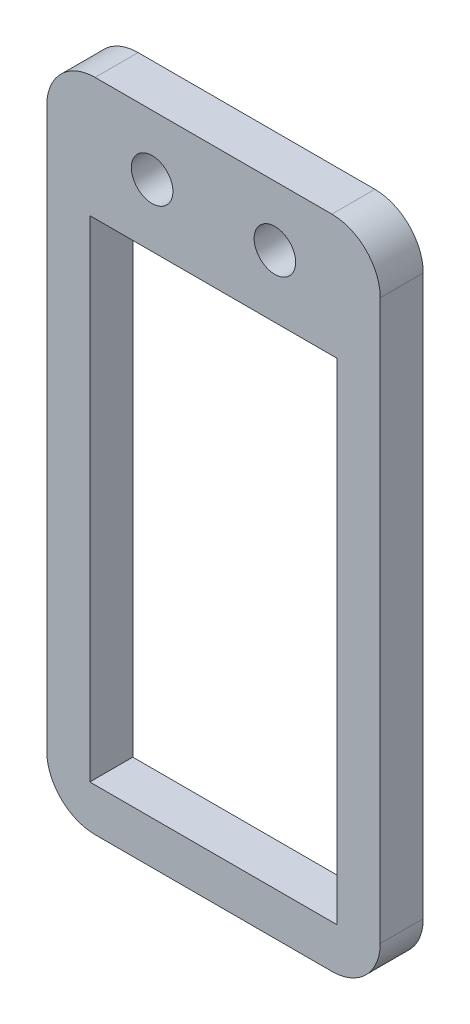
ISO-10303-21;
HEADER;
FILE_DESCRIPTION(('STEP AP214'),'2;1');
FILE_NAME('part.step','',(''),(''),'','','');
FILE_SCHEMA(('AUTOMOTIVE_DESIGN { 1 0 10303 214 1 1 1 1 }'));
ENDSEC;
DATA;
#1=APPLICATION_CONTEXT('core data for automotive mechanical design processes');
#2=APPLICATION_PROTOCOL_DEFINITION('international standard','automotive_design',2000,#1);
#3=PRODUCT_CONTEXT('',#1,'mechanical');
#4=PRODUCT('Part','Part','',(#3));
#5=PRODUCT_RELATED_PRODUCT_CATEGORY('part','',(#4));
#6=PRODUCT_DEFINITION_FORMATION('','',#4);
#7=PRODUCT_DEFINITION_CONTEXT('part definition',#1,'design');
#8=PRODUCT_DEFINITION('design','',#6,#7);
#9=PRODUCT_DEFINITION_SHAPE('','',#8);
#10=(LENGTH_UNIT() NAMED_UNIT(*) SI_UNIT(.MILLI.,.METRE.));
#11=(NAMED_UNIT(*) PLANE_ANGLE_UNIT() SI_UNIT($,.RADIAN.));
#12=(NAMED_UNIT(*) SI_UNIT($,.STERADIAN.) SOLID_ANGLE_UNIT());
#13=UNCERTAINTY_MEASURE_WITH_UNIT(LENGTH_MEASURE(1.E-05),#10,'distance_accuracy_value','');
#14=(GEOMETRIC_REPRESENTATION_CONTEXT(3) GLOBAL_UNCERTAINTY_ASSIGNED_CONTEXT((#13)) GLOBAL_UNIT_ASSIGNED_CONTEXT((#10,
#11,#12)) REPRESENTATION_CONTEXT('',''));
#15=CARTESIAN_POINT('',(0.,0.,0.));
#16=DIRECTION('',(0.,0.,1.));
#17=DIRECTION('',(1.,0.,0.));
#18=AXIS2_PLACEMENT_3D('',#15,#16,#17);
#19=CARTESIAN_POINT('',(0.,0.,-20.8282705688341));
#20=DIRECTION('',(0.,0.,1.));
#21=DIRECTION('',(1.,0.,0.));
#22=AXIS2_PLACEMENT_3D('',#19,#20,#21);
#23=PLANE('',#22);
#24=CARTESIAN_POINT('',(6.35,0.,-20.8282705688341));
#25=DIRECTION('',(0.,0.,1.));
#26=DIRECTION('',(1.,0.,0.));
#27=AXIS2_PLACEMENT_3D('',#24,#25,#26);
#28=CIRCLE('',#27,2.15);
#29=CARTESIAN_POINT('',(8.5,0.,-20.8282705688341));
#30=VERTEX_POINT('',#29);
#31=EDGE_CURVE('E163',#30,#30,#28,.T.);
#32=ORIENTED_EDGE('',*,*,#31,.F.);
#33=EDGE_LOOP('',(#32));
#34=FACE_BOUND('',#33,.T.);
#35=DIRECTION('',(0.,-1.,0.));
#36=VECTOR('',#35,1.);
#37=CARTESIAN_POINT('',(-4.54999999999981,-61.653,-20.8282705688341));
#38=LINE('',#37,#36);
#39=CARTESIAN_POINT('',(-4.54999999999981,1.20000000000001,-20.8282705688341));
#40=VERTEX_POINT('',#39);
#41=CARTESIAN_POINT('',(-4.54999999999981,-56.653,-20.8282705688341));
#42=VERTEX_POINT('',#41);
#43=EDGE_CURVE('E179',#40,#42,#38,.T.);
#44=ORIENTED_EDGE('',*,*,#43,.T.);
#45=CARTESIAN_POINT('',(0.45000000000019,-56.653,-20.8282705688341));
#46=DIRECTION('',(0.,0.,1.));
#47=DIRECTION('',(1.,0.,0.));
#48=AXIS2_PLACEMENT_3D('',#45,#46,#47);
#49=CIRCLE('',#48,5.);
#50=CARTESIAN_POINT('',(0.45000000000019,-61.653,-20.8282705688341));
#51=VERTEX_POINT('',#50);
#52=EDGE_CURVE('E217',#42,#51,#49,.T.);
#53=ORIENTED_EDGE('',*,*,#52,.T.);
#54=DIRECTION('',(1.,0.,0.));
#55=VECTOR('',#54,1.);
#56=CARTESIAN_POINT('',(29.9500000000002,-61.653,-20.8282705688341));
#57=LINE('',#56,#55);
#58=CARTESIAN_POINT('',(24.9500000000002,-61.653,-20.8282705688341));
#59=VERTEX_POINT('',#58);
#60=EDGE_CURVE('E182',#51,#59,#57,.T.);
#61=ORIENTED_EDGE('',*,*,#60,.T.);
#62=CARTESIAN_POINT('',(24.9500000000002,-56.653,-20.8282705688341));
#63=DIRECTION('',(0.,0.,1.));
#64=DIRECTION('',(1.,0.,0.));
#65=AXIS2_PLACEMENT_3D('',#62,#63,#64);
#66=CIRCLE('',#65,5.);
#67=CARTESIAN_POINT('',(29.9500000000002,-56.653,-20.8282705688341));
#68=VERTEX_POINT('',#67);
#69=EDGE_CURVE('E215',#59,#68,#66,.T.);
#70=ORIENTED_EDGE('',*,*,#69,.T.);
#71=DIRECTION('',(0.,1.,0.));
#72=VECTOR('',#71,1.);
#73=CARTESIAN_POINT('',(29.9500000000002,-61.653,-20.8282705688341));
#74=LINE('',#73,#72);
#75=CARTESIAN_POINT('',(29.9500000000002,1.20000000000002,-20.8282705688341));
#76=VERTEX_POINT('',#75);
#77=EDGE_CURVE('E174',#68,#76,#74,.T.);
#78=ORIENTED_EDGE('',*,*,#77,.T.);
#79=CARTESIAN_POINT('',(24.9500000000002,1.20000000000002,-20.8282705688341));
#80=DIRECTION('',(0.,0.,1.));
#81=DIRECTION('',(1.,0.,0.));
#82=AXIS2_PLACEMENT_3D('',#79,#80,#81);
#83=CIRCLE('',#82,5.);
#84=CARTESIAN_POINT('',(24.9500000000002,6.20000000000002,-20.8282705688341));
#85=VERTEX_POINT('',#84);
#86=EDGE_CURVE('E60',#76,#85,#83,.T.);
#87=ORIENTED_EDGE('',*,*,#86,.T.);
#88=DIRECTION('',(-1.,0.,0.));
#89=VECTOR('',#88,1.);
#90=CARTESIAN_POINT('',(29.9500000000002,6.20000000000002,-20.8282705688341));
#91=LINE('',#90,#89);
#92=CARTESIAN_POINT('',(0.450000000000186,6.20000000000001,-20.8282705688341));
#93=VERTEX_POINT('',#92);
#94=EDGE_CURVE('E176',#85,#93,#91,.T.);
#95=ORIENTED_EDGE('',*,*,#94,.T.);
#96=CARTESIAN_POINT('',(0.450000000000188,1.20000000000001,-20.8282705688341));
#97=DIRECTION('',(0.,0.,1.));
#98=DIRECTION('',(1.,0.,0.));
#99=AXIS2_PLACEMENT_3D('',#96,#97,#98);
#100=CIRCLE('',#99,5.);
#101=EDGE_CURVE('E212',#93,#40,#100,.T.);
#102=ORIENTED_EDGE('',*,*,#101,.T.);
#103=EDGE_LOOP('',(#44,#53,#61,#70,#78,#87,#95,#102));
#104=FACE_BOUND('',#103,.T.);
#105=DIRECTION('',(-1.,0.,0.));
#106=VECTOR('',#105,1.);
#107=CARTESIAN_POINT('',(25.5000000000002,-6.453,-20.8282705688341));
#108=LINE('',#107,#106);
#109=CARTESIAN_POINT('',(25.5000000000002,-6.453,-20.8282705688341));
#110=VERTEX_POINT('',#109);
#111=CARTESIAN_POINT('',(-0.0999999999998133,-6.453,-20.8282705688341));
#112=VERTEX_POINT('',#111);
#113=EDGE_CURVE('E140',#110,#112,#108,.T.);
#114=ORIENTED_EDGE('',*,*,#113,.F.);
#115=DIRECTION('',(0.,1.,0.));
#116=VECTOR('',#115,1.);
#117=CARTESIAN_POINT('',(25.5000000000002,-57.203,-20.8282705688341));
#118=LINE('',#117,#116);
#119=CARTESIAN_POINT('',(25.5000000000002,-57.203,-20.8282705688341));
#120=VERTEX_POINT('',#119);
#121=EDGE_CURVE('E130',#120,#110,#118,.T.);
#122=ORIENTED_EDGE('',*,*,#121,.F.);
#123=DIRECTION('',(1.,0.,0.));
#124=VECTOR('',#123,1.);
#125=CARTESIAN_POINT('',(25.5000000000002,-57.203,-20.8282705688341));
#126=LINE('',#125,#124);
#127=CARTESIAN_POINT('',(-0.0999999999998118,-57.203,-20.8282705688341));
#128=VERTEX_POINT('',#127);
#129=EDGE_CURVE('E156',#128,#120,#126,.T.);
#130=ORIENTED_EDGE('',*,*,#129,.F.);
#131=DIRECTION('',(0.,-1.,0.));
#132=VECTOR('',#131,1.);
#133=CARTESIAN_POINT('',(-0.0999999999998118,-57.203,-20.8282705688341));
#134=LINE('',#133,#132);
#135=EDGE_CURVE('E154',#112,#128,#134,.T.);
#136=ORIENTED_EDGE('',*,*,#135,.F.);
#137=EDGE_LOOP('',(#114,#122,#130,#136));
#138=FACE_BOUND('',#137,.T.);
#139=CARTESIAN_POINT('',(19.0500000000002,0.,-20.8282705688341));
#140=DIRECTION('',(0.,0.,1.));
#141=DIRECTION('',(1.,0.,0.));
#142=AXIS2_PLACEMENT_3D('',#139,#140,#141);
#143=CIRCLE('',#142,2.15);
#144=CARTESIAN_POINT('',(21.2000000000002,0.,-20.8282705688341));
#145=VERTEX_POINT('',#144);
#146=EDGE_CURVE('E404',#145,#145,#143,.T.);
#147=ORIENTED_EDGE('',*,*,#146,.F.);
#148=EDGE_LOOP('',(#147));
#149=FACE_BOUND('',#148,.T.);
#150=ADVANCED_FACE('F39',(#34,#104,#138,#149),#23,.T.);
#151=CARTESIAN_POINT('',(0.,0.,-25.2782705688341));
#152=DIRECTION('',(0.,0.,1.));
#153=DIRECTION('',(1.,0.,0.));
#154=AXIS2_PLACEMENT_3D('',#151,#152,#153);
#155=PLANE('',#154);
#156=DIRECTION('',(1.,0.,0.));
#157=VECTOR('',#156,1.);
#158=CARTESIAN_POINT('',(29.9500000000002,-61.653,-25.2782705688341));
#159=LINE('',#158,#157);
#160=CARTESIAN_POINT('',(0.45000000000019,-61.653,-25.2782705688341));
#161=VERTEX_POINT('',#160);
#162=CARTESIAN_POINT('',(24.9500000000002,-61.653,-25.2782705688341));
#163=VERTEX_POINT('',#162);
#164=EDGE_CURVE('E177',#161,#163,#159,.T.);
#165=ORIENTED_EDGE('',*,*,#164,.F.);
#166=CARTESIAN_POINT('',(0.45000000000019,-56.653,-25.2782705688341));
#167=DIRECTION('',(0.,0.,1.));
#168=DIRECTION('',(1.,0.,0.));
#169=AXIS2_PLACEMENT_3D('',#166,#167,#168);
#170=CIRCLE('',#169,5.);
#171=CARTESIAN_POINT('',(-4.54999999999981,-56.653,-25.2782705688341));
#172=VERTEX_POINT('',#171);
#173=EDGE_CURVE('E205',#161,#172,#170,.F.);
#174=ORIENTED_EDGE('',*,*,#173,.T.);
#175=DIRECTION('',(0.,-1.,0.));
#176=VECTOR('',#175,1.);
#177=CARTESIAN_POINT('',(-4.54999999999981,-61.653,-25.2782705688341));
#178=LINE('',#177,#176);
#179=CARTESIAN_POINT('',(-4.54999999999981,1.20000000000001,-25.2782705688341));
#180=VERTEX_POINT('',#179);
#181=EDGE_CURVE('E190',#180,#172,#178,.T.);
#182=ORIENTED_EDGE('',*,*,#181,.F.);
#183=CARTESIAN_POINT('',(0.450000000000188,1.20000000000001,-25.2782705688341));
#184=DIRECTION('',(0.,0.,1.));
#185=DIRECTION('',(1.,0.,0.));
#186=AXIS2_PLACEMENT_3D('',#183,#184,#185);
#187=CIRCLE('',#186,5.);
#188=CARTESIAN_POINT('',(0.450000000000186,6.20000000000001,-25.2782705688341));
#189=VERTEX_POINT('',#188);
#190=EDGE_CURVE('E199',#180,#189,#187,.F.);
#191=ORIENTED_EDGE('',*,*,#190,.T.);
#192=DIRECTION('',(-1.,0.,0.));
#193=VECTOR('',#192,1.);
#194=CARTESIAN_POINT('',(29.9500000000002,6.20000000000002,-25.2782705688341));
#195=LINE('',#194,#193);
#196=CARTESIAN_POINT('',(24.9500000000002,6.20000000000002,-25.2782705688341));
#197=VERTEX_POINT('',#196);
#198=EDGE_CURVE('E188',#197,#189,#195,.T.);
#199=ORIENTED_EDGE('',*,*,#198,.F.);
#200=CARTESIAN_POINT('',(24.9500000000002,1.20000000000002,-25.2782705688341));
#201=DIRECTION('',(0.,0.,1.));
#202=DIRECTION('',(1.,0.,0.));
#203=AXIS2_PLACEMENT_3D('',#200,#201,#202);
#204=CIRCLE('',#203,5.);
#205=CARTESIAN_POINT('',(29.9500000000002,1.20000000000002,-25.2782705688341));
#206=VERTEX_POINT('',#205);
#207=EDGE_CURVE('E201',#197,#206,#204,.F.);
#208=ORIENTED_EDGE('',*,*,#207,.T.);
#209=DIRECTION('',(0.,1.,0.));
#210=VECTOR('',#209,1.);
#211=CARTESIAN_POINT('',(29.9500000000002,-61.653,-25.2782705688341));
#212=LINE('',#211,#210);
#213=CARTESIAN_POINT('',(29.9500000000002,-56.653,-25.2782705688341));
#214=VERTEX_POINT('',#213);
#215=EDGE_CURVE('E148',#214,#206,#212,.T.);
#216=ORIENTED_EDGE('',*,*,#215,.F.);
#217=CARTESIAN_POINT('',(24.9500000000002,-56.653,-25.2782705688341));
#218=DIRECTION('',(0.,0.,1.));
#219=DIRECTION('',(1.,0.,0.));
#220=AXIS2_PLACEMENT_3D('',#217,#218,#219);
#221=CIRCLE('',#220,5.);
#222=EDGE_CURVE('E203',#214,#163,#221,.F.);
#223=ORIENTED_EDGE('',*,*,#222,.T.);
#224=EDGE_LOOP('',(#165,#174,#182,#191,#199,#208,#216,#223));
#225=FACE_BOUND('',#224,.T.);
#226=DIRECTION('',(0.,1.,0.));
#227=VECTOR('',#226,1.);
#228=CARTESIAN_POINT('',(25.5000000000002,-57.203,-25.2782705688341));
#229=LINE('',#228,#227);
#230=CARTESIAN_POINT('',(25.5000000000002,-57.203,-25.2782705688341));
#231=VERTEX_POINT('',#230);
#232=CARTESIAN_POINT('',(25.5000000000002,-6.453,-25.2782705688341));
#233=VERTEX_POINT('',#232);
#234=EDGE_CURVE('E161',#231,#233,#229,.T.);
#235=ORIENTED_EDGE('',*,*,#234,.T.);
#236=DIRECTION('',(-1.,0.,0.));
#237=VECTOR('',#236,1.);
#238=CARTESIAN_POINT('',(25.5000000000002,-6.453,-25.2782705688341));
#239=LINE('',#238,#237);
#240=CARTESIAN_POINT('',(-0.0999999999998133,-6.453,-25.2782705688341));
#241=VERTEX_POINT('',#240);
#242=EDGE_CURVE('E147',#233,#241,#239,.T.);
#243=ORIENTED_EDGE('',*,*,#242,.T.);
#244=DIRECTION('',(0.,-1.,0.));
#245=VECTOR('',#244,1.);
#246=CARTESIAN_POINT('',(-0.0999999999998118,-57.203,-25.2782705688341));
#247=LINE('',#246,#245);
#248=CARTESIAN_POINT('',(-0.0999999999998118,-57.203,-25.2782705688341));
#249=VERTEX_POINT('',#248);
#250=EDGE_CURVE('E165',#241,#249,#247,.T.);
#251=ORIENTED_EDGE('',*,*,#250,.T.);
#252=DIRECTION('',(1.,0.,0.));
#253=VECTOR('',#252,1.);
#254=CARTESIAN_POINT('',(25.5000000000002,-57.203,-25.2782705688341));
#255=LINE('',#254,#253);
#256=EDGE_CURVE('E141',#249,#231,#255,.T.);
#257=ORIENTED_EDGE('',*,*,#256,.T.);
#258=EDGE_LOOP('',(#235,#243,#251,#257));
#259=FACE_BOUND('',#258,.T.);
#260=CARTESIAN_POINT('',(6.35,0.,-25.2782705688341));
#261=DIRECTION('',(0.,0.,1.));
#262=DIRECTION('',(1.,0.,0.));
#263=AXIS2_PLACEMENT_3D('',#260,#261,#262);
#264=CIRCLE('',#263,2.15);
#265=CARTESIAN_POINT('',(8.5,0.,-25.2782705688341));
#266=VERTEX_POINT('',#265);
#267=EDGE_CURVE('E399',#266,#266,#264,.T.);
#268=ORIENTED_EDGE('',*,*,#267,.T.);
#269=EDGE_LOOP('',(#268));
#270=FACE_BOUND('',#269,.T.);
#271=CARTESIAN_POINT('',(19.0500000000002,0.,-25.2782705688341));
#272=DIRECTION('',(0.,0.,1.));
#273=DIRECTION('',(1.,0.,0.));
#274=AXIS2_PLACEMENT_3D('',#271,#272,#273);
#275=CIRCLE('',#274,2.15);
#276=CARTESIAN_POINT('',(21.2000000000002,0.,-25.2782705688341));
#277=VERTEX_POINT('',#276);
#278=EDGE_CURVE('E402',#277,#277,#275,.T.);
#279=ORIENTED_EDGE('',*,*,#278,.T.);
#280=EDGE_LOOP('',(#279));
#281=FACE_BOUND('',#280,.T.);
#282=ADVANCED_FACE('F233',(#225,#259,#270,#281),#155,.F.);
#283=CARTESIAN_POINT('',(29.9500000000002,-61.653,-20.8282705688341));
#284=DIRECTION('',(-1.,0.,0.));
#285=DIRECTION('',(0.,0.,1.));
#286=AXIS2_PLACEMENT_3D('',#283,#284,#285);
#287=PLANE('',#286);
#288=ORIENTED_EDGE('',*,*,#77,.F.);
#289=DIRECTION('',(0.,0.,-1.));
#290=VECTOR('',#289,1.);
#291=CARTESIAN_POINT('',(29.9500000000002,-56.653,-20.8282705688341));
#292=LINE('',#291,#290);
#293=EDGE_CURVE('E221',#68,#214,#292,.T.);
#294=ORIENTED_EDGE('',*,*,#293,.T.);
#295=ORIENTED_EDGE('',*,*,#215,.T.);
#296=DIRECTION('',(0.,0.,-1.));
#297=VECTOR('',#296,1.);
#298=CARTESIAN_POINT('',(29.9500000000002,1.20000000000002,-20.8282705688341));
#299=LINE('',#298,#297);
#300=EDGE_CURVE('E219',#206,#76,#299,.F.);
#301=ORIENTED_EDGE('',*,*,#300,.T.);
#302=EDGE_LOOP('',(#288,#294,#295,#301));
#303=FACE_BOUND('',#302,.T.);
#304=ADVANCED_FACE('F227',(#303),#287,.F.);
#305=CARTESIAN_POINT('',(29.9500000000002,6.20000000000002,-20.8282705688341));
#306=DIRECTION('',(0.,-1.,0.));
#307=DIRECTION('',(1.,0.,0.));
#308=AXIS2_PLACEMENT_3D('',#305,#306,#307);
#309=PLANE('',#308);
#310=ORIENTED_EDGE('',*,*,#94,.F.);
#311=DIRECTION('',(0.,0.,-1.));
#312=VECTOR('',#311,1.);
#313=CARTESIAN_POINT('',(24.9500000000002,6.20000000000002,-20.8282705688341));
#314=LINE('',#313,#312);
#315=EDGE_CURVE('E11',#85,#197,#314,.T.);
#316=ORIENTED_EDGE('',*,*,#315,.T.);
#317=ORIENTED_EDGE('',*,*,#198,.T.);
#318=DIRECTION('',(0.,0.,-1.));
#319=VECTOR('',#318,1.);
#320=CARTESIAN_POINT('',(0.450000000000186,6.20000000000001,-20.8282705688341));
#321=LINE('',#320,#319);
#322=EDGE_CURVE('E47',#189,#93,#321,.F.);
#323=ORIENTED_EDGE('',*,*,#322,.T.);
#324=EDGE_LOOP('',(#310,#316,#317,#323));
#325=FACE_BOUND('',#324,.T.);
#326=ADVANCED_FACE('F239',(#325),#309,.F.);
#327=CARTESIAN_POINT('',(-4.54999999999981,-61.653,-20.8282705688341));
#328=DIRECTION('',(1.,0.,0.));
#329=DIRECTION('',(0.,1.,0.));
#330=AXIS2_PLACEMENT_3D('',#327,#328,#329);
#331=PLANE('',#330);
#332=ORIENTED_EDGE('',*,*,#181,.T.);
#333=DIRECTION('',(0.,0.,-1.));
#334=VECTOR('',#333,1.);
#335=CARTESIAN_POINT('',(-4.54999999999981,-56.653,-20.8282705688341));
#336=LINE('',#335,#334);
#337=EDGE_CURVE('E210',#172,#42,#336,.F.);
#338=ORIENTED_EDGE('',*,*,#337,.T.);
#339=ORIENTED_EDGE('',*,*,#43,.F.);
#340=DIRECTION('',(0.,0.,-1.));
#341=VECTOR('',#340,1.);
#342=CARTESIAN_POINT('',(-4.54999999999981,1.20000000000001,-20.8282705688341));
#343=LINE('',#342,#341);
#344=EDGE_CURVE('E207',#40,#180,#343,.T.);
#345=ORIENTED_EDGE('',*,*,#344,.T.);
#346=EDGE_LOOP('',(#332,#338,#339,#345));
#347=FACE_BOUND('',#346,.T.);
#348=ADVANCED_FACE('F246',(#347),#331,.F.);
#349=CARTESIAN_POINT('',(29.9500000000002,-61.653,-20.8282705688341));
#350=DIRECTION('',(0.,1.,0.));
#351=DIRECTION('',(-1.,0.,0.));
#352=AXIS2_PLACEMENT_3D('',#349,#350,#351);
#353=PLANE('',#352);
#354=ORIENTED_EDGE('',*,*,#60,.F.);
#355=DIRECTION('',(0.,0.,-1.));
#356=VECTOR('',#355,1.);
#357=CARTESIAN_POINT('',(0.45000000000019,-61.653,-20.8282705688341));
#358=LINE('',#357,#356);
#359=EDGE_CURVE('E196',#51,#161,#358,.T.);
#360=ORIENTED_EDGE('',*,*,#359,.T.);
#361=ORIENTED_EDGE('',*,*,#164,.T.);
#362=DIRECTION('',(0.,0.,-1.));
#363=VECTOR('',#362,1.);
#364=CARTESIAN_POINT('',(24.9500000000002,-61.653,-20.8282705688341));
#365=LINE('',#364,#363);
#366=EDGE_CURVE('E185',#163,#59,#365,.F.);
#367=ORIENTED_EDGE('',*,*,#366,.T.);
#368=EDGE_LOOP('',(#354,#360,#361,#367));
#369=FACE_BOUND('',#368,.T.);
#370=ADVANCED_FACE('F254',(#369),#353,.F.);
#371=CARTESIAN_POINT('',(25.5000000000002,-57.203,-20.8282705688341));
#372=DIRECTION('',(-1.,0.,0.));
#373=DIRECTION('',(0.,0.,1.));
#374=AXIS2_PLACEMENT_3D('',#371,#372,#373);
#375=PLANE('',#374);
#376=ORIENTED_EDGE('',*,*,#234,.F.);
#377=DIRECTION('',(0.,0.,-1.));
#378=VECTOR('',#377,1.);
#379=CARTESIAN_POINT('',(25.5000000000002,-57.203,-20.8282705688341));
#380=LINE('',#379,#378);
#381=EDGE_CURVE('E136',#120,#231,#380,.T.);
#382=ORIENTED_EDGE('',*,*,#381,.F.);
#383=ORIENTED_EDGE('',*,*,#121,.T.);
#384=DIRECTION('',(0.,0.,-1.));
#385=VECTOR('',#384,1.);
#386=CARTESIAN_POINT('',(25.5000000000002,-6.453,-20.8282705688341));
#387=LINE('',#386,#385);
#388=EDGE_CURVE('E133',#110,#233,#387,.T.);
#389=ORIENTED_EDGE('',*,*,#388,.T.);
#390=EDGE_LOOP('',(#376,#382,#383,#389));
#391=FACE_BOUND('',#390,.T.);
#392=ADVANCED_FACE('F132',(#391),#375,.T.);
#393=CARTESIAN_POINT('',(25.5000000000002,-6.453,-20.8282705688341));
#394=DIRECTION('',(0.,-1.,0.));
#395=DIRECTION('',(1.,0.,0.));
#396=AXIS2_PLACEMENT_3D('',#393,#394,#395);
#397=PLANE('',#396);
#398=ORIENTED_EDGE('',*,*,#242,.F.);
#399=ORIENTED_EDGE('',*,*,#388,.F.);
#400=ORIENTED_EDGE('',*,*,#113,.T.);
#401=DIRECTION('',(0.,0.,-1.));
#402=VECTOR('',#401,1.);
#403=CARTESIAN_POINT('',(-0.0999999999998133,-6.453,-20.8282705688341));
#404=LINE('',#403,#402);
#405=EDGE_CURVE('E149',#112,#241,#404,.T.);
#406=ORIENTED_EDGE('',*,*,#405,.T.);
#407=EDGE_LOOP('',(#398,#399,#400,#406));
#408=FACE_BOUND('',#407,.T.);
#409=ADVANCED_FACE('F144',(#408),#397,.T.);
#410=CARTESIAN_POINT('',(-0.0999999999998118,-57.203,-20.8282705688341));
#411=DIRECTION('',(1.,0.,0.));
#412=DIRECTION('',(0.,1.,0.));
#413=AXIS2_PLACEMENT_3D('',#410,#411,#412);
#414=PLANE('',#413);
#415=ORIENTED_EDGE('',*,*,#250,.F.);
#416=ORIENTED_EDGE('',*,*,#405,.F.);
#417=ORIENTED_EDGE('',*,*,#135,.T.);
#418=DIRECTION('',(0.,0.,-1.));
#419=VECTOR('',#418,1.);
#420=CARTESIAN_POINT('',(-0.0999999999998118,-57.203,-20.8282705688341));
#421=LINE('',#420,#419);
#422=EDGE_CURVE('E171',#128,#249,#421,.T.);
#423=ORIENTED_EDGE('',*,*,#422,.T.);
#424=EDGE_LOOP('',(#415,#416,#417,#423));
#425=FACE_BOUND('',#424,.T.);
#426=ADVANCED_FACE('F355',(#425),#414,.T.);
#427=CARTESIAN_POINT('',(25.5000000000002,-57.203,-20.8282705688341));
#428=DIRECTION('',(0.,1.,0.));
#429=DIRECTION('',(0.,0.,1.));
#430=AXIS2_PLACEMENT_3D('',#427,#428,#429);
#431=PLANE('',#430);
#432=ORIENTED_EDGE('',*,*,#256,.F.);
#433=ORIENTED_EDGE('',*,*,#422,.F.);
#434=ORIENTED_EDGE('',*,*,#129,.T.);
#435=ORIENTED_EDGE('',*,*,#381,.T.);
#436=EDGE_LOOP('',(#432,#433,#434,#435));
#437=FACE_BOUND('',#436,.T.);
#438=ADVANCED_FACE('F345',(#437),#431,.T.);
#439=CARTESIAN_POINT('',(6.35,0.,-20.8282705688341));
#440=DIRECTION('',(0.,0.,-1.));
#441=DIRECTION('',(-1.,0.,0.));
#442=AXIS2_PLACEMENT_3D('',#439,#440,#441);
#443=CYLINDRICAL_SURFACE('',#442,2.15);
#444=ORIENTED_EDGE('',*,*,#31,.T.);
#445=EDGE_LOOP('',(#444));
#446=FACE_BOUND('',#445,.T.);
#447=ORIENTED_EDGE('',*,*,#267,.F.);
#448=EDGE_LOOP('',(#447));
#449=FACE_BOUND('',#448,.T.);
#450=ADVANCED_FACE('F335',(#446,#449),#443,.F.);
#451=CARTESIAN_POINT('',(19.0500000000002,0.,-20.8282705688341));
#452=DIRECTION('',(0.,0.,-1.));
#453=DIRECTION('',(-1.,0.,0.));
#454=AXIS2_PLACEMENT_3D('',#451,#452,#453);
#455=CYLINDRICAL_SURFACE('',#454,2.15);
#456=ORIENTED_EDGE('',*,*,#146,.T.);
#457=EDGE_LOOP('',(#456));
#458=FACE_BOUND('',#457,.T.);
#459=ORIENTED_EDGE('',*,*,#278,.F.);
#460=EDGE_LOOP('',(#459));
#461=FACE_BOUND('',#460,.T.);
#462=ADVANCED_FACE('F263',(#458,#461),#455,.F.);
#463=CARTESIAN_POINT('',(0.45000000000019,-56.653,-20.8282705688341));
#464=DIRECTION('',(0.,0.,-1.));
#465=DIRECTION('',(-1.,0.,0.));
#466=AXIS2_PLACEMENT_3D('',#463,#464,#465);
#467=CYLINDRICAL_SURFACE('',#466,5.);
#468=ORIENTED_EDGE('',*,*,#52,.F.);
#469=ORIENTED_EDGE('',*,*,#337,.F.);
#470=ORIENTED_EDGE('',*,*,#173,.F.);
#471=ORIENTED_EDGE('',*,*,#359,.F.);
#472=EDGE_LOOP('',(#468,#469,#470,#471));
#473=FACE_BOUND('',#472,.T.);
#474=ADVANCED_FACE('F251',(#473),#467,.T.);
#475=CARTESIAN_POINT('',(24.9500000000002,-56.653,-20.8282705688341));
#476=DIRECTION('',(0.,0.,-1.));
#477=DIRECTION('',(-1.,0.,0.));
#478=AXIS2_PLACEMENT_3D('',#475,#476,#477);
#479=CYLINDRICAL_SURFACE('',#478,5.);
#480=ORIENTED_EDGE('',*,*,#69,.F.);
#481=ORIENTED_EDGE('',*,*,#366,.F.);
#482=ORIENTED_EDGE('',*,*,#222,.F.);
#483=ORIENTED_EDGE('',*,*,#293,.F.);
#484=EDGE_LOOP('',(#480,#481,#482,#483));
#485=FACE_BOUND('',#484,.T.);
#486=ADVANCED_FACE('F256',(#485),#479,.T.);
#487=CARTESIAN_POINT('',(24.9500000000002,1.20000000000002,-20.8282705688341));
#488=DIRECTION('',(0.,0.,-1.));
#489=DIRECTION('',(-1.,0.,0.));
#490=AXIS2_PLACEMENT_3D('',#487,#488,#489);
#491=CYLINDRICAL_SURFACE('',#490,5.);
#492=ORIENTED_EDGE('',*,*,#86,.F.);
#493=ORIENTED_EDGE('',*,*,#300,.F.);
#494=ORIENTED_EDGE('',*,*,#207,.F.);
#495=ORIENTED_EDGE('',*,*,#315,.F.);
#496=EDGE_LOOP('',(#492,#493,#494,#495));
#497=FACE_BOUND('',#496,.T.);
#498=ADVANCED_FACE('F238',(#497),#491,.T.);
#499=CARTESIAN_POINT('',(0.450000000000188,1.20000000000001,-20.8282705688341));
#500=DIRECTION('',(0.,0.,-1.));
#501=DIRECTION('',(-1.,0.,0.));
#502=AXIS2_PLACEMENT_3D('',#499,#500,#501);
#503=CYLINDRICAL_SURFACE('',#502,5.);
#504=ORIENTED_EDGE('',*,*,#101,.F.);
#505=ORIENTED_EDGE('',*,*,#322,.F.);
#506=ORIENTED_EDGE('',*,*,#190,.F.);
#507=ORIENTED_EDGE('',*,*,#344,.F.);
#508=EDGE_LOOP('',(#504,#505,#506,#507));
#509=FACE_BOUND('',#508,.T.);
#510=ADVANCED_FACE('F41',(#509),#503,.T.);
#511=CLOSED_SHELL('',(#150,#282,#304,#326,#348,#370,#392,#409,#426,#438,#450,#462,#474,#486,
#498,#510));
#512=MANIFOLD_SOLID_BREP('B2',#511);
#513=ADVANCED_BREP_SHAPE_REPRESENTATION('',(#18,#512),#14);
#514=SHAPE_DEFINITION_REPRESENTATION(#9,#513);
ENDSEC;
END-ISO-10303-21;
